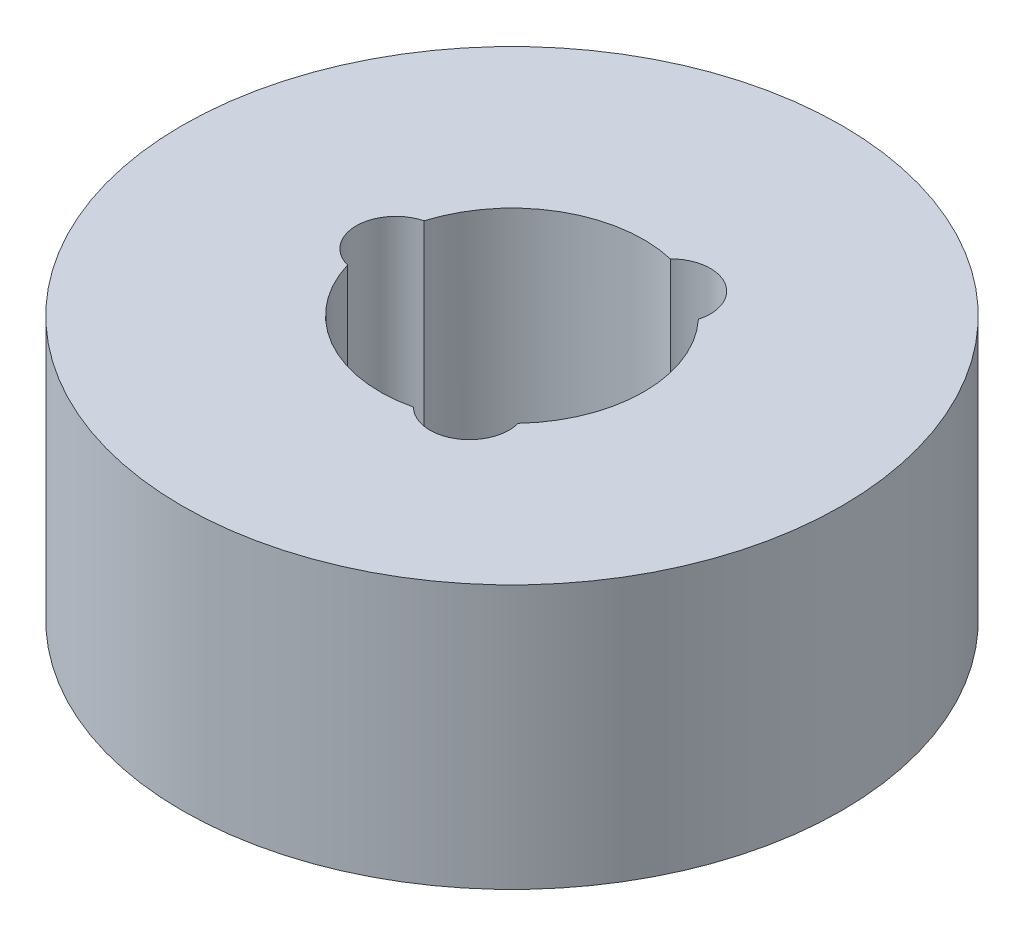
ISO-10303-21;
HEADER;
FILE_DESCRIPTION(('STEP AP214'),'2;1');
FILE_NAME('part.step','',(''),(''),'','','');
FILE_SCHEMA(('AUTOMOTIVE_DESIGN { 1 0 10303 214 1 1 1 1 }'));
ENDSEC;
DATA;
#1=APPLICATION_CONTEXT('core data for automotive mechanical design processes');
#2=APPLICATION_PROTOCOL_DEFINITION('international standard','automotive_design',2000,#1);
#3=PRODUCT_CONTEXT('',#1,'mechanical');
#4=PRODUCT('Part','Part','',(#3));
#5=PRODUCT_RELATED_PRODUCT_CATEGORY('part','',(#4));
#6=PRODUCT_DEFINITION_FORMATION('','',#4);
#7=PRODUCT_DEFINITION_CONTEXT('part definition',#1,'design');
#8=PRODUCT_DEFINITION('design','',#6,#7);
#9=PRODUCT_DEFINITION_SHAPE('','',#8);
#10=(LENGTH_UNIT() NAMED_UNIT(*) SI_UNIT(.MILLI.,.METRE.));
#11=(NAMED_UNIT(*) PLANE_ANGLE_UNIT() SI_UNIT($,.RADIAN.));
#12=(NAMED_UNIT(*) SI_UNIT($,.STERADIAN.) SOLID_ANGLE_UNIT());
#13=UNCERTAINTY_MEASURE_WITH_UNIT(LENGTH_MEASURE(1.E-05),#10,'distance_accuracy_value','');
#14=(GEOMETRIC_REPRESENTATION_CONTEXT(3) GLOBAL_UNCERTAINTY_ASSIGNED_CONTEXT((#13)) GLOBAL_UNIT_ASSIGNED_CONTEXT((#10,
#11,#12)) REPRESENTATION_CONTEXT('',''));
#15=CARTESIAN_POINT('',(0.,0.,0.));
#16=DIRECTION('',(0.,0.,1.));
#17=DIRECTION('',(1.,0.,0.));
#18=AXIS2_PLACEMENT_3D('',#15,#16,#17);
#19=CARTESIAN_POINT('',(0.,10.,0.));
#20=DIRECTION('',(0.,-1.,0.));
#21=DIRECTION('',(0.,0.,-1.));
#22=AXIS2_PLACEMENT_3D('',#19,#20,#21);
#23=CYLINDRICAL_SURFACE('',#22,12.5);
#24=CARTESIAN_POINT('',(0.,10.,0.));
#25=DIRECTION('',(0.,1.,0.));
#26=DIRECTION('',(0.,0.,1.));
#27=AXIS2_PLACEMENT_3D('',#24,#25,#26);
#28=CIRCLE('',#27,12.5);
#29=CARTESIAN_POINT('',(0.,10.,12.5));
#30=VERTEX_POINT('',#29);
#31=EDGE_CURVE('E130',#30,#30,#28,.T.);
#32=ORIENTED_EDGE('',*,*,#31,.F.);
#33=EDGE_LOOP('',(#32));
#34=FACE_BOUND('',#33,.T.);
#35=CARTESIAN_POINT('',(0.,0.,0.));
#36=DIRECTION('',(0.,1.,0.));
#37=DIRECTION('',(0.,0.,1.));
#38=AXIS2_PLACEMENT_3D('',#35,#36,#37);
#39=CIRCLE('',#38,12.5);
#40=CARTESIAN_POINT('',(0.,0.,12.5));
#41=VERTEX_POINT('',#40);
#42=EDGE_CURVE('E117',#41,#41,#39,.T.);
#43=ORIENTED_EDGE('',*,*,#42,.T.);
#44=EDGE_LOOP('',(#43));
#45=FACE_BOUND('',#44,.T.);
#46=ADVANCED_FACE('F39',(#34,#45),#23,.T.);
#47=CARTESIAN_POINT('',(0.,10.,0.));
#48=DIRECTION('',(0.,1.,0.));
#49=DIRECTION('',(0.,0.,1.));
#50=AXIS2_PLACEMENT_3D('',#47,#48,#49);
#51=PLANE('',#50);
#52=CARTESIAN_POINT('',(2.2030791624704,10.,3.81584504249498));
#53=DIRECTION('',(0.,1.,0.));
#54=DIRECTION('',(0.866025403784436,0.,-0.500000000000004));
#55=AXIS2_PLACEMENT_3D('',#52,#53,#54);
#56=CIRCLE('',#55,1.5);
#57=CARTESIAN_POINT('',(1.13535273081718,10.,4.86939156123493));
#58=VERTEX_POINT('',#57);
#59=CARTESIAN_POINT('',(3.64934042759446,10.,3.41794008776114));
#60=VERTEX_POINT('',#59);
#61=EDGE_CURVE('E148',#58,#60,#56,.T.);
#62=ORIENTED_EDGE('',*,*,#61,.F.);
#63=CARTESIAN_POINT('',(0.,10.,0.));
#64=DIRECTION('',(0.,1.,0.));
#65=DIRECTION('',(0.,0.,1.));
#66=AXIS2_PLACEMENT_3D('',#63,#64,#65);
#67=CIRCLE('',#66,5.);
#68=CARTESIAN_POINT('',(-4.7846931584116,10.,1.45145147347378));
#69=VERTEX_POINT('',#68);
#70=EDGE_CURVE('E113',#69,#58,#67,.T.);
#71=ORIENTED_EDGE('',*,*,#70,.F.);
#72=CARTESIAN_POINT('',(-4.40615832494076,10.,0.));
#73=DIRECTION('',(0.,1.,0.));
#74=DIRECTION('',(0.,0.,1.));
#75=AXIS2_PLACEMENT_3D('',#72,#73,#74);
#76=CIRCLE('',#75,1.5);
#77=CARTESIAN_POINT('',(-4.7846931584116,10.,-1.45145147347378));
#78=VERTEX_POINT('',#77);
#79=EDGE_CURVE('E125',#78,#69,#76,.T.);
#80=ORIENTED_EDGE('',*,*,#79,.F.);
#81=CARTESIAN_POINT('',(1.13535273081711,10.,-4.86939156123495));
#82=VERTEX_POINT('',#81);
#83=EDGE_CURVE('E107',#82,#78,#67,.T.);
#84=ORIENTED_EDGE('',*,*,#83,.F.);
#85=CARTESIAN_POINT('',(2.20307916247034,10.,-3.81584504249501));
#86=DIRECTION('',(0.,1.,0.));
#87=DIRECTION('',(-0.866025403784443,0.,-0.499999999999992));
#88=AXIS2_PLACEMENT_3D('',#85,#86,#87);
#89=CIRCLE('',#88,1.5);
#90=CARTESIAN_POINT('',(3.64934042759442,10.,-3.41794008776119));
#91=VERTEX_POINT('',#90);
#92=EDGE_CURVE('E95',#91,#82,#89,.T.);
#93=ORIENTED_EDGE('',*,*,#92,.F.);
#94=EDGE_CURVE('E106',#60,#91,#67,.T.);
#95=ORIENTED_EDGE('',*,*,#94,.F.);
#96=EDGE_LOOP('',(#62,#71,#80,#84,#93,#95));
#97=FACE_BOUND('',#96,.T.);
#98=ORIENTED_EDGE('',*,*,#31,.T.);
#99=EDGE_LOOP('',(#98));
#100=FACE_BOUND('',#99,.T.);
#101=ADVANCED_FACE('F102',(#97,#100),#51,.T.);
#102=CARTESIAN_POINT('',(0.,0.,0.));
#103=DIRECTION('',(0.,1.,0.));
#104=DIRECTION('',(0.,0.,1.));
#105=AXIS2_PLACEMENT_3D('',#102,#103,#104);
#106=PLANE('',#105);
#107=CARTESIAN_POINT('',(0.,0.,0.));
#108=DIRECTION('',(0.,1.,0.));
#109=DIRECTION('',(0.,0.,1.));
#110=AXIS2_PLACEMENT_3D('',#107,#108,#109);
#111=CIRCLE('',#110,5.);
#112=CARTESIAN_POINT('',(0.,0.,5.));
#113=VERTEX_POINT('',#112);
#114=EDGE_CURVE('E118',#113,#113,#111,.T.);
#115=ORIENTED_EDGE('',*,*,#114,.T.);
#116=EDGE_LOOP('',(#115));
#117=FACE_BOUND('',#116,.T.);
#118=ORIENTED_EDGE('',*,*,#42,.F.);
#119=EDGE_LOOP('',(#118));
#120=FACE_BOUND('',#119,.T.);
#121=ADVANCED_FACE('F161',(#117,#120),#106,.F.);
#122=CARTESIAN_POINT('',(0.,10.,0.));
#123=DIRECTION('',(0.,-1.,0.));
#124=DIRECTION('',(0.,0.,-1.));
#125=AXIS2_PLACEMENT_3D('',#122,#123,#124);
#126=CYLINDRICAL_SURFACE('',#125,5.);
#127=DIRECTION('',(0.,1.,0.));
#128=VECTOR('',#127,1.);
#129=CARTESIAN_POINT('',(1.13535273081718,5.7222914994108,4.86939156123493));
#130=LINE('',#129,#128);
#131=CARTESIAN_POINT('',(1.13535273081718,1.44458299882159,4.86939156123493));
#132=VERTEX_POINT('',#131);
#133=EDGE_CURVE('E11',#132,#58,#130,.T.);
#134=ORIENTED_EDGE('',*,*,#133,.F.);
#135=CARTESIAN_POINT('',(0.,1.44458299882159,0.));
#136=DIRECTION('',(0.,1.,0.));
#137=DIRECTION('',(0.,0.,1.));
#138=AXIS2_PLACEMENT_3D('',#135,#136,#137);
#139=CIRCLE('',#138,5.);
#140=CARTESIAN_POINT('',(3.64934042759446,1.44458299882159,3.41794008776114));
#141=VERTEX_POINT('',#140);
#142=EDGE_CURVE('E100',#132,#141,#139,.T.);
#143=ORIENTED_EDGE('',*,*,#142,.T.);
#144=DIRECTION('',(0.,1.,0.));
#145=VECTOR('',#144,1.);
#146=CARTESIAN_POINT('',(3.64934042759446,5.7222914994108,3.41794008776114));
#147=LINE('',#146,#145);
#148=EDGE_CURVE('E46',#60,#141,#147,.F.);
#149=ORIENTED_EDGE('',*,*,#148,.F.);
#150=ORIENTED_EDGE('',*,*,#94,.T.);
#151=DIRECTION('',(0.,1.,0.));
#152=VECTOR('',#151,1.);
#153=CARTESIAN_POINT('',(3.64934042759442,5.7222914994108,-3.41794008776119));
#154=LINE('',#153,#152);
#155=CARTESIAN_POINT('',(3.64934042759442,1.44458299882159,-3.41794008776119));
#156=VERTEX_POINT('',#155);
#157=EDGE_CURVE('E90',#156,#91,#154,.T.);
#158=ORIENTED_EDGE('',*,*,#157,.F.);
#159=CARTESIAN_POINT('',(0.,1.44458299882159,0.));
#160=DIRECTION('',(0.,1.,0.));
#161=DIRECTION('',(0.,0.,1.));
#162=AXIS2_PLACEMENT_3D('',#159,#160,#161);
#163=CIRCLE('',#162,5.);
#164=CARTESIAN_POINT('',(1.13535273081711,1.44458299882159,-4.86939156123495));
#165=VERTEX_POINT('',#164);
#166=EDGE_CURVE('E143',#156,#165,#163,.T.);
#167=ORIENTED_EDGE('',*,*,#166,.T.);
#168=DIRECTION('',(0.,1.,0.));
#169=VECTOR('',#168,1.);
#170=CARTESIAN_POINT('',(1.13535273081711,5.7222914994108,-4.86939156123495));
#171=LINE('',#170,#169);
#172=EDGE_CURVE('E98',#82,#165,#171,.F.);
#173=ORIENTED_EDGE('',*,*,#172,.F.);
#174=ORIENTED_EDGE('',*,*,#83,.T.);
#175=DIRECTION('',(0.,1.,0.));
#176=VECTOR('',#175,1.);
#177=CARTESIAN_POINT('',(-4.7846931584116,5.7222914994108,-1.45145147347378));
#178=LINE('',#177,#176);
#179=CARTESIAN_POINT('',(-4.7846931584116,1.44458299882159,-1.45145147347378));
#180=VERTEX_POINT('',#179);
#181=EDGE_CURVE('E137',#180,#78,#178,.T.);
#182=ORIENTED_EDGE('',*,*,#181,.F.);
#183=CARTESIAN_POINT('',(0.,1.44458299882159,0.));
#184=DIRECTION('',(0.,1.,0.));
#185=DIRECTION('',(0.,0.,1.));
#186=AXIS2_PLACEMENT_3D('',#183,#184,#185);
#187=CIRCLE('',#186,5.);
#188=CARTESIAN_POINT('',(-4.7846931584116,1.44458299882159,1.45145147347378));
#189=VERTEX_POINT('',#188);
#190=EDGE_CURVE('E128',#180,#189,#187,.T.);
#191=ORIENTED_EDGE('',*,*,#190,.T.);
#192=DIRECTION('',(0.,1.,0.));
#193=VECTOR('',#192,1.);
#194=CARTESIAN_POINT('',(-4.7846931584116,5.7222914994108,1.45145147347378));
#195=LINE('',#194,#193);
#196=EDGE_CURVE('E134',#69,#189,#195,.F.);
#197=ORIENTED_EDGE('',*,*,#196,.F.);
#198=ORIENTED_EDGE('',*,*,#70,.T.);
#199=EDGE_LOOP('',(#134,#143,#149,#150,#158,#167,#173,#174,#182,#191,#197,#198));
#200=FACE_BOUND('',#199,.T.);
#201=ORIENTED_EDGE('',*,*,#114,.F.);
#202=EDGE_LOOP('',(#201));
#203=FACE_BOUND('',#202,.T.);
#204=ADVANCED_FACE('F115',(#200,#203),#126,.F.);
#205=CARTESIAN_POINT('',(-4.40615832494076,1.44458299882159,0.));
#206=DIRECTION('',(0.,1.,0.));
#207=DIRECTION('',(0.,0.,1.));
#208=AXIS2_PLACEMENT_3D('',#205,#206,#207);
#209=CYLINDRICAL_SURFACE('',#208,1.5);
#210=ORIENTED_EDGE('',*,*,#181,.T.);
#211=ORIENTED_EDGE('',*,*,#79,.T.);
#212=ORIENTED_EDGE('',*,*,#196,.T.);
#213=CARTESIAN_POINT('',(-4.40615832494076,1.44458299882159,0.));
#214=DIRECTION('',(0.,1.,0.));
#215=DIRECTION('',(0.,0.,1.));
#216=AXIS2_PLACEMENT_3D('',#213,#214,#215);
#217=CIRCLE('',#216,1.5);
#218=EDGE_CURVE('E127',#180,#189,#217,.T.);
#219=ORIENTED_EDGE('',*,*,#218,.F.);
#220=EDGE_LOOP('',(#210,#211,#212,#219));
#221=FACE_BOUND('',#220,.T.);
#222=ADVANCED_FACE('F175',(#221),#209,.F.);
#223=CARTESIAN_POINT('',(-4.40615832494076,1.44458299882159,0.));
#224=DIRECTION('',(0.,1.,0.));
#225=DIRECTION('',(0.,0.,1.));
#226=AXIS2_PLACEMENT_3D('',#223,#224,#225);
#227=PLANE('',#226);
#228=ORIENTED_EDGE('',*,*,#218,.T.);
#229=ORIENTED_EDGE('',*,*,#190,.F.);
#230=EDGE_LOOP('',(#228,#229));
#231=FACE_BOUND('',#230,.T.);
#232=ADVANCED_FACE('F176',(#231),#227,.T.);
#233=CARTESIAN_POINT('',(2.20307916247034,1.44458299882159,-3.81584504249501));
#234=DIRECTION('',(0.,1.,0.));
#235=DIRECTION('',(0.,0.,1.));
#236=AXIS2_PLACEMENT_3D('',#233,#234,#235);
#237=CYLINDRICAL_SURFACE('',#236,1.5);
#238=ORIENTED_EDGE('',*,*,#157,.T.);
#239=ORIENTED_EDGE('',*,*,#92,.T.);
#240=ORIENTED_EDGE('',*,*,#172,.T.);
#241=CARTESIAN_POINT('',(2.20307916247034,1.44458299882159,-3.81584504249501));
#242=DIRECTION('',(0.,1.,0.));
#243=DIRECTION('',(-0.866025403784443,0.,-0.499999999999992));
#244=AXIS2_PLACEMENT_3D('',#241,#242,#243);
#245=CIRCLE('',#244,1.5);
#246=EDGE_CURVE('E56',#156,#165,#245,.T.);
#247=ORIENTED_EDGE('',*,*,#246,.F.);
#248=EDGE_LOOP('',(#238,#239,#240,#247));
#249=FACE_BOUND('',#248,.T.);
#250=ADVANCED_FACE('F93',(#249),#237,.F.);
#251=CARTESIAN_POINT('',(2.20307916247034,1.44458299882159,-3.81584504249501));
#252=DIRECTION('',(0.,1.,0.));
#253=DIRECTION('',(-0.866025403784443,0.,-0.499999999999992));
#254=AXIS2_PLACEMENT_3D('',#251,#252,#253);
#255=PLANE('',#254);
#256=ORIENTED_EDGE('',*,*,#246,.T.);
#257=ORIENTED_EDGE('',*,*,#166,.F.);
#258=EDGE_LOOP('',(#256,#257));
#259=FACE_BOUND('',#258,.T.);
#260=ADVANCED_FACE('F153',(#259),#255,.T.);
#261=CARTESIAN_POINT('',(2.2030791624704,1.44458299882159,3.81584504249498));
#262=DIRECTION('',(0.,1.,0.));
#263=DIRECTION('',(0.,0.,1.));
#264=AXIS2_PLACEMENT_3D('',#261,#262,#263);
#265=CYLINDRICAL_SURFACE('',#264,1.5);
#266=ORIENTED_EDGE('',*,*,#133,.T.);
#267=ORIENTED_EDGE('',*,*,#61,.T.);
#268=ORIENTED_EDGE('',*,*,#148,.T.);
#269=CARTESIAN_POINT('',(2.2030791624704,1.44458299882159,3.81584504249498));
#270=DIRECTION('',(0.,1.,0.));
#271=DIRECTION('',(0.866025403784436,0.,-0.500000000000004));
#272=AXIS2_PLACEMENT_3D('',#269,#270,#271);
#273=CIRCLE('',#272,1.5);
#274=EDGE_CURVE('E55',#132,#141,#273,.T.);
#275=ORIENTED_EDGE('',*,*,#274,.F.);
#276=EDGE_LOOP('',(#266,#267,#268,#275));
#277=FACE_BOUND('',#276,.T.);
#278=ADVANCED_FACE('F144',(#277),#265,.F.);
#279=CARTESIAN_POINT('',(2.2030791624704,1.44458299882159,3.81584504249498));
#280=DIRECTION('',(0.,1.,0.));
#281=DIRECTION('',(0.866025403784436,0.,-0.500000000000004));
#282=AXIS2_PLACEMENT_3D('',#279,#280,#281);
#283=PLANE('',#282);
#284=ORIENTED_EDGE('',*,*,#274,.T.);
#285=ORIENTED_EDGE('',*,*,#142,.F.);
#286=EDGE_LOOP('',(#284,#285));
#287=FACE_BOUND('',#286,.T.);
#288=ADVANCED_FACE('F150',(#287),#283,.T.);
#289=CLOSED_SHELL('',(#46,#101,#121,#204,#222,#232,#250,#260,#278,#288));
#290=MANIFOLD_SOLID_BREP('B2',#289);
#291=ADVANCED_BREP_SHAPE_REPRESENTATION('',(#18,#290),#14);
#292=SHAPE_DEFINITION_REPRESENTATION(#9,#291);
ENDSEC;
END-ISO-10303-21;
